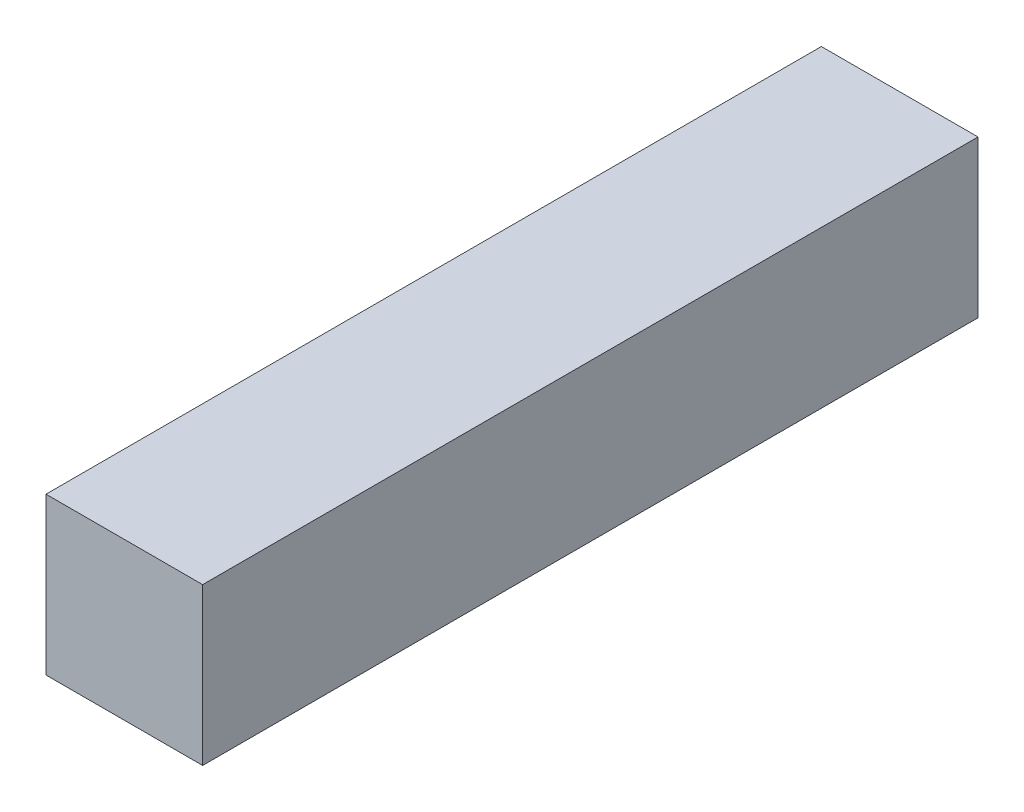
ISO-10303-21;
HEADER;
FILE_DESCRIPTION(('STEP AP214'),'2;1');
FILE_NAME('part.step','',(''),(''),'','','');
FILE_SCHEMA(('AUTOMOTIVE_DESIGN { 1 0 10303 214 1 1 1 1 }'));
ENDSEC;
DATA;
#1=APPLICATION_CONTEXT('core data for automotive mechanical design processes');
#2=APPLICATION_PROTOCOL_DEFINITION('international standard','automotive_design',2000,#1);
#3=PRODUCT_CONTEXT('',#1,'mechanical');
#4=PRODUCT('Part','Part','',(#3));
#5=PRODUCT_RELATED_PRODUCT_CATEGORY('part','',(#4));
#6=PRODUCT_DEFINITION_FORMATION('','',#4);
#7=PRODUCT_DEFINITION_CONTEXT('part definition',#1,'design');
#8=PRODUCT_DEFINITION('design','',#6,#7);
#9=PRODUCT_DEFINITION_SHAPE('','',#8);
#10=(LENGTH_UNIT() NAMED_UNIT(*) SI_UNIT(.MILLI.,.METRE.));
#11=(NAMED_UNIT(*) PLANE_ANGLE_UNIT() SI_UNIT($,.RADIAN.));
#12=(NAMED_UNIT(*) SI_UNIT($,.STERADIAN.) SOLID_ANGLE_UNIT());
#13=UNCERTAINTY_MEASURE_WITH_UNIT(LENGTH_MEASURE(1.E-05),#10,'distance_accuracy_value','');
#14=(GEOMETRIC_REPRESENTATION_CONTEXT(3) GLOBAL_UNCERTAINTY_ASSIGNED_CONTEXT((#13)) GLOBAL_UNIT_ASSIGNED_CONTEXT((#10,
#11,#12)) REPRESENTATION_CONTEXT('',''));
#15=CARTESIAN_POINT('',(0.,0.,0.));
#16=DIRECTION('',(0.,0.,1.));
#17=DIRECTION('',(1.,0.,0.));
#18=AXIS2_PLACEMENT_3D('',#15,#16,#17);
#19=CARTESIAN_POINT('',(-1.,2.,4.95));
#20=DIRECTION('',(1.,0.,0.));
#21=DIRECTION('',(0.,0.,-1.));
#22=AXIS2_PLACEMENT_3D('',#19,#20,#21);
#23=PLANE('',#22);
#24=DIRECTION('',(0.,0.,1.));
#25=VECTOR('',#24,1.);
#26=CARTESIAN_POINT('',(-1.,0.,4.95));
#27=LINE('',#26,#25);
#28=CARTESIAN_POINT('',(-1.,0.,-4.95));
#29=VERTEX_POINT('',#28);
#30=CARTESIAN_POINT('',(-1.,0.,4.95));
#31=VERTEX_POINT('',#30);
#32=EDGE_CURVE('E107',#29,#31,#27,.T.);
#33=ORIENTED_EDGE('',*,*,#32,.T.);
#34=DIRECTION('',(0.,-1.,0.));
#35=VECTOR('',#34,1.);
#36=CARTESIAN_POINT('',(-1.,2.,4.95));
#37=LINE('',#36,#35);
#38=CARTESIAN_POINT('',(-1.,2.,4.95));
#39=VERTEX_POINT('',#38);
#40=EDGE_CURVE('E11',#39,#31,#37,.T.);
#41=ORIENTED_EDGE('',*,*,#40,.F.);
#42=DIRECTION('',(0.,0.,1.));
#43=VECTOR('',#42,1.);
#44=CARTESIAN_POINT('',(-1.,2.,4.95));
#45=LINE('',#44,#43);
#46=CARTESIAN_POINT('',(-1.,2.,-4.95));
#47=VERTEX_POINT('',#46);
#48=EDGE_CURVE('E89',#47,#39,#45,.T.);
#49=ORIENTED_EDGE('',*,*,#48,.F.);
#50=DIRECTION('',(0.,-1.,0.));
#51=VECTOR('',#50,1.);
#52=CARTESIAN_POINT('',(-1.,2.,-4.95));
#53=LINE('',#52,#51);
#54=EDGE_CURVE('E103',#47,#29,#53,.T.);
#55=ORIENTED_EDGE('',*,*,#54,.T.);
#56=EDGE_LOOP('',(#33,#41,#49,#55));
#57=FACE_BOUND('',#56,.T.);
#58=ADVANCED_FACE('F37',(#57),#23,.F.);
#59=CARTESIAN_POINT('',(1.,2.,4.95));
#60=DIRECTION('',(0.,0.,-1.));
#61=DIRECTION('',(-1.,0.,0.));
#62=AXIS2_PLACEMENT_3D('',#59,#60,#61);
#63=PLANE('',#62);
#64=DIRECTION('',(1.,0.,0.));
#65=VECTOR('',#64,1.);
#66=CARTESIAN_POINT('',(1.,0.,4.95));
#67=LINE('',#66,#65);
#68=CARTESIAN_POINT('',(1.,0.,4.95));
#69=VERTEX_POINT('',#68);
#70=EDGE_CURVE('E94',#31,#69,#67,.T.);
#71=ORIENTED_EDGE('',*,*,#70,.T.);
#72=DIRECTION('',(0.,-1.,0.));
#73=VECTOR('',#72,1.);
#74=CARTESIAN_POINT('',(1.,2.,4.95));
#75=LINE('',#74,#73);
#76=CARTESIAN_POINT('',(1.,2.,4.95));
#77=VERTEX_POINT('',#76);
#78=EDGE_CURVE('E46',#77,#69,#75,.T.);
#79=ORIENTED_EDGE('',*,*,#78,.F.);
#80=DIRECTION('',(1.,0.,0.));
#81=VECTOR('',#80,1.);
#82=CARTESIAN_POINT('',(1.,2.,4.95));
#83=LINE('',#82,#81);
#84=EDGE_CURVE('E84',#39,#77,#83,.T.);
#85=ORIENTED_EDGE('',*,*,#84,.F.);
#86=ORIENTED_EDGE('',*,*,#40,.T.);
#87=EDGE_LOOP('',(#71,#79,#85,#86));
#88=FACE_BOUND('',#87,.T.);
#89=ADVANCED_FACE('F93',(#88),#63,.F.);
#90=CARTESIAN_POINT('',(1.,2.,4.95));
#91=DIRECTION('',(-1.,0.,0.));
#92=DIRECTION('',(0.,0.,1.));
#93=AXIS2_PLACEMENT_3D('',#90,#91,#92);
#94=PLANE('',#93);
#95=DIRECTION('',(0.,0.,-1.));
#96=VECTOR('',#95,1.);
#97=CARTESIAN_POINT('',(1.,0.,4.95));
#98=LINE('',#97,#96);
#99=CARTESIAN_POINT('',(1.,0.,-4.95));
#100=VERTEX_POINT('',#99);
#101=EDGE_CURVE('E71',#69,#100,#98,.T.);
#102=ORIENTED_EDGE('',*,*,#101,.T.);
#103=DIRECTION('',(0.,-1.,0.));
#104=VECTOR('',#103,1.);
#105=CARTESIAN_POINT('',(1.,2.,-4.95));
#106=LINE('',#105,#104);
#107=CARTESIAN_POINT('',(1.,2.,-4.95));
#108=VERTEX_POINT('',#107);
#109=EDGE_CURVE('E96',#108,#100,#106,.T.);
#110=ORIENTED_EDGE('',*,*,#109,.F.);
#111=DIRECTION('',(0.,0.,-1.));
#112=VECTOR('',#111,1.);
#113=CARTESIAN_POINT('',(1.,2.,4.95));
#114=LINE('',#113,#112);
#115=EDGE_CURVE('E87',#77,#108,#114,.T.);
#116=ORIENTED_EDGE('',*,*,#115,.F.);
#117=ORIENTED_EDGE('',*,*,#78,.T.);
#118=EDGE_LOOP('',(#102,#110,#116,#117));
#119=FACE_BOUND('',#118,.T.);
#120=ADVANCED_FACE('F97',(#119),#94,.F.);
#121=CARTESIAN_POINT('',(1.,2.,-4.95));
#122=DIRECTION('',(0.,0.,1.));
#123=DIRECTION('',(1.,0.,0.));
#124=AXIS2_PLACEMENT_3D('',#121,#122,#123);
#125=PLANE('',#124);
#126=DIRECTION('',(-1.,0.,0.));
#127=VECTOR('',#126,1.);
#128=CARTESIAN_POINT('',(1.,0.,-4.95));
#129=LINE('',#128,#127);
#130=EDGE_CURVE('E77',#100,#29,#129,.T.);
#131=ORIENTED_EDGE('',*,*,#130,.T.);
#132=ORIENTED_EDGE('',*,*,#54,.F.);
#133=DIRECTION('',(-1.,0.,0.));
#134=VECTOR('',#133,1.);
#135=CARTESIAN_POINT('',(1.,2.,-4.95));
#136=LINE('',#135,#134);
#137=EDGE_CURVE('E54',#108,#47,#136,.T.);
#138=ORIENTED_EDGE('',*,*,#137,.F.);
#139=ORIENTED_EDGE('',*,*,#109,.T.);
#140=EDGE_LOOP('',(#131,#132,#138,#139));
#141=FACE_BOUND('',#140,.T.);
#142=ADVANCED_FACE('F119',(#141),#125,.F.);
#143=CARTESIAN_POINT('',(0.,2.,0.));
#144=DIRECTION('',(0.,1.,0.));
#145=DIRECTION('',(0.,0.,1.));
#146=AXIS2_PLACEMENT_3D('',#143,#144,#145);
#147=PLANE('',#146);
#148=ORIENTED_EDGE('',*,*,#48,.T.);
#149=ORIENTED_EDGE('',*,*,#84,.T.);
#150=ORIENTED_EDGE('',*,*,#115,.T.);
#151=ORIENTED_EDGE('',*,*,#137,.T.);
#152=EDGE_LOOP('',(#148,#149,#150,#151));
#153=FACE_BOUND('',#152,.T.);
#154=ADVANCED_FACE('F85',(#153),#147,.T.);
#155=CARTESIAN_POINT('',(0.,0.,0.));
#156=DIRECTION('',(0.,1.,0.));
#157=DIRECTION('',(0.,0.,1.));
#158=AXIS2_PLACEMENT_3D('',#155,#156,#157);
#159=PLANE('',#158);
#160=ORIENTED_EDGE('',*,*,#32,.F.);
#161=ORIENTED_EDGE('',*,*,#130,.F.);
#162=ORIENTED_EDGE('',*,*,#101,.F.);
#163=ORIENTED_EDGE('',*,*,#70,.F.);
#164=EDGE_LOOP('',(#160,#161,#162,#163));
#165=FACE_BOUND('',#164,.T.);
#166=ADVANCED_FACE('F122',(#165),#159,.F.);
#167=CLOSED_SHELL('',(#58,#89,#120,#142,#154,#166));
#168=MANIFOLD_SOLID_BREP('B2',#167);
#169=ADVANCED_BREP_SHAPE_REPRESENTATION('',(#18,#168),#14);
#170=SHAPE_DEFINITION_REPRESENTATION(#9,#169);
ENDSEC;
END-ISO-10303-21;
